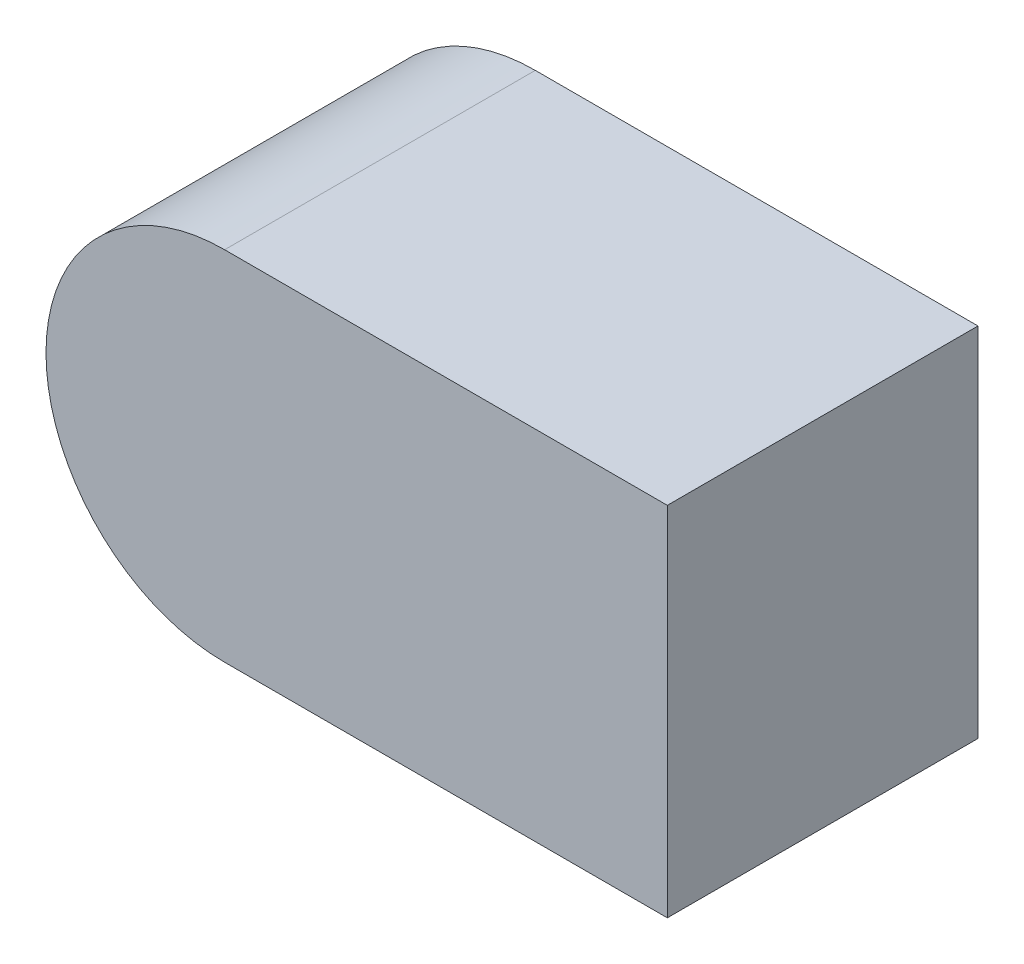
ISO-10303-21;
HEADER;
FILE_DESCRIPTION(('STEP AP214'),'2;1');
FILE_NAME('part.step','',(''),(''),'','','');
FILE_SCHEMA(('AUTOMOTIVE_DESIGN { 1 0 10303 214 1 1 1 1 }'));
ENDSEC;
DATA;
#1=APPLICATION_CONTEXT('core data for automotive mechanical design processes');
#2=APPLICATION_PROTOCOL_DEFINITION('international standard','automotive_design',2000,#1);
#3=PRODUCT_CONTEXT('',#1,'mechanical');
#4=PRODUCT('Part','Part','',(#3));
#5=PRODUCT_RELATED_PRODUCT_CATEGORY('part','',(#4));
#6=PRODUCT_DEFINITION_FORMATION('','',#4);
#7=PRODUCT_DEFINITION_CONTEXT('part definition',#1,'design');
#8=PRODUCT_DEFINITION('design','',#6,#7);
#9=PRODUCT_DEFINITION_SHAPE('','',#8);
#10=(LENGTH_UNIT() NAMED_UNIT(*) SI_UNIT(.MILLI.,.METRE.));
#11=(NAMED_UNIT(*) PLANE_ANGLE_UNIT() SI_UNIT($,.RADIAN.));
#12=(NAMED_UNIT(*) SI_UNIT($,.STERADIAN.) SOLID_ANGLE_UNIT());
#13=UNCERTAINTY_MEASURE_WITH_UNIT(LENGTH_MEASURE(1.E-05),#10,'distance_accuracy_value','');
#14=(GEOMETRIC_REPRESENTATION_CONTEXT(3) GLOBAL_UNCERTAINTY_ASSIGNED_CONTEXT((#13)) GLOBAL_UNIT_ASSIGNED_CONTEXT((#10,
#11,#12)) REPRESENTATION_CONTEXT('',''));
#15=CARTESIAN_POINT('',(0.,0.,0.));
#16=DIRECTION('',(0.,0.,1.));
#17=DIRECTION('',(1.,0.,0.));
#18=AXIS2_PLACEMENT_3D('',#15,#16,#17);
#19=CARTESIAN_POINT('',(2.8335265642716,0.75,0.));
#20=DIRECTION('',(0.,0.,1.));
#21=DIRECTION('',(-1.,0.,0.));
#22=AXIS2_PLACEMENT_3D('',#19,#20,#21);
#23=PLANE('',#22);
#24=DIRECTION('',(0.,1.,0.));
#25=VECTOR('',#24,1.);
#26=CARTESIAN_POINT('',(3.,0.635,0.));
#27=LINE('',#26,#25);
#28=CARTESIAN_POINT('',(3.,0.635,0.));
#29=VERTEX_POINT('',#28);
#30=CARTESIAN_POINT('',(3.,0.865,0.));
#31=VERTEX_POINT('',#30);
#32=EDGE_CURVE('E11',#29,#31,#27,.T.);
#33=ORIENTED_EDGE('',*,*,#32,.F.);
#34=DIRECTION('',(1.,0.,0.));
#35=VECTOR('',#34,1.);
#36=CARTESIAN_POINT('',(2.715,0.635,0.));
#37=LINE('',#36,#35);
#38=CARTESIAN_POINT('',(2.715,0.635,0.));
#39=VERTEX_POINT('',#38);
#40=EDGE_CURVE('E24',#39,#29,#37,.T.);
#41=ORIENTED_EDGE('',*,*,#40,.F.);
#42=CARTESIAN_POINT('',(2.715,0.75,0.));
#43=DIRECTION('',(0.,0.,1.));
#44=DIRECTION('',(0.,1.,0.));
#45=AXIS2_PLACEMENT_3D('',#42,#43,#44);
#46=CIRCLE('',#45,0.115);
#47=CARTESIAN_POINT('',(2.715,0.865,0.));
#48=VERTEX_POINT('',#47);
#49=EDGE_CURVE('E85',#48,#39,#46,.T.);
#50=ORIENTED_EDGE('',*,*,#49,.F.);
#51=DIRECTION('',(-1.,0.,0.));
#52=VECTOR('',#51,1.);
#53=CARTESIAN_POINT('',(3.,0.865,0.));
#54=LINE('',#53,#52);
#55=EDGE_CURVE('E82',#31,#48,#54,.T.);
#56=ORIENTED_EDGE('',*,*,#55,.F.);
#57=EDGE_LOOP('',(#33,#41,#50,#56));
#58=FACE_BOUND('',#57,.T.);
#59=ADVANCED_FACE('F17',(#58),#23,.F.);
#60=CARTESIAN_POINT('',(3.,0.865,0.));
#61=DIRECTION('',(0.,1.,0.));
#62=DIRECTION('',(-1.,0.,0.));
#63=AXIS2_PLACEMENT_3D('',#60,#61,#62);
#64=PLANE('',#63);
#65=ORIENTED_EDGE('',*,*,#55,.T.);
#66=DIRECTION('',(0.,0.,1.));
#67=VECTOR('',#66,1.);
#68=CARTESIAN_POINT('',(2.715,0.865,0.));
#69=LINE('',#68,#67);
#70=CARTESIAN_POINT('',(2.715,0.865,0.2));
#71=VERTEX_POINT('',#70);
#72=EDGE_CURVE('E80',#48,#71,#69,.T.);
#73=ORIENTED_EDGE('',*,*,#72,.T.);
#74=DIRECTION('',(-1.,0.,0.));
#75=VECTOR('',#74,1.);
#76=CARTESIAN_POINT('',(3.,0.865,0.2));
#77=LINE('',#76,#75);
#78=CARTESIAN_POINT('',(3.,0.865,0.2));
#79=VERTEX_POINT('',#78);
#80=EDGE_CURVE('E78',#79,#71,#77,.T.);
#81=ORIENTED_EDGE('',*,*,#80,.F.);
#82=DIRECTION('',(0.,0.,-1.));
#83=VECTOR('',#82,1.);
#84=CARTESIAN_POINT('',(3.,0.865,0.));
#85=LINE('',#84,#83);
#86=EDGE_CURVE('E71',#79,#31,#85,.T.);
#87=ORIENTED_EDGE('',*,*,#86,.T.);
#88=EDGE_LOOP('',(#65,#73,#81,#87));
#89=FACE_BOUND('',#88,.T.);
#90=ADVANCED_FACE('F91',(#89),#64,.T.);
#91=CARTESIAN_POINT('',(2.715,0.75,0.));
#92=DIRECTION('',(0.,0.,1.));
#93=DIRECTION('',(0.,1.,0.));
#94=AXIS2_PLACEMENT_3D('',#91,#92,#93);
#95=CYLINDRICAL_SURFACE('',#94,0.115);
#96=ORIENTED_EDGE('',*,*,#49,.T.);
#97=DIRECTION('',(0.,0.,1.));
#98=VECTOR('',#97,1.);
#99=CARTESIAN_POINT('',(2.715,0.635,0.));
#100=LINE('',#99,#98);
#101=CARTESIAN_POINT('',(2.715,0.635,0.2));
#102=VERTEX_POINT('',#101);
#103=EDGE_CURVE('E75',#39,#102,#100,.T.);
#104=ORIENTED_EDGE('',*,*,#103,.T.);
#105=CARTESIAN_POINT('',(2.715,0.75,0.2));
#106=DIRECTION('',(0.,0.,1.));
#107=DIRECTION('',(0.,1.,0.));
#108=AXIS2_PLACEMENT_3D('',#105,#106,#107);
#109=CIRCLE('',#108,0.115);
#110=EDGE_CURVE('E59',#71,#102,#109,.T.);
#111=ORIENTED_EDGE('',*,*,#110,.F.);
#112=ORIENTED_EDGE('',*,*,#72,.F.);
#113=EDGE_LOOP('',(#96,#104,#111,#112));
#114=FACE_BOUND('',#113,.T.);
#115=ADVANCED_FACE('F89',(#114),#95,.T.);
#116=CARTESIAN_POINT('',(2.715,0.635,0.));
#117=DIRECTION('',(0.,-1.,0.));
#118=DIRECTION('',(1.,0.,0.));
#119=AXIS2_PLACEMENT_3D('',#116,#117,#118);
#120=PLANE('',#119);
#121=ORIENTED_EDGE('',*,*,#40,.T.);
#122=DIRECTION('',(0.,0.,1.));
#123=VECTOR('',#122,1.);
#124=CARTESIAN_POINT('',(3.,0.635,0.));
#125=LINE('',#124,#123);
#126=CARTESIAN_POINT('',(3.,0.635,0.2));
#127=VERTEX_POINT('',#126);
#128=EDGE_CURVE('E53',#29,#127,#125,.T.);
#129=ORIENTED_EDGE('',*,*,#128,.T.);
#130=DIRECTION('',(1.,0.,0.));
#131=VECTOR('',#130,1.);
#132=CARTESIAN_POINT('',(2.715,0.635,0.2));
#133=LINE('',#132,#131);
#134=EDGE_CURVE('E57',#102,#127,#133,.T.);
#135=ORIENTED_EDGE('',*,*,#134,.F.);
#136=ORIENTED_EDGE('',*,*,#103,.F.);
#137=EDGE_LOOP('',(#121,#129,#135,#136));
#138=FACE_BOUND('',#137,.T.);
#139=ADVANCED_FACE('F55',(#138),#120,.T.);
#140=CARTESIAN_POINT('',(3.,-3.,0.));
#141=DIRECTION('',(1.,0.,0.));
#142=DIRECTION('',(0.,1.,0.));
#143=AXIS2_PLACEMENT_3D('',#140,#141,#142);
#144=PLANE('',#143);
#145=ORIENTED_EDGE('',*,*,#86,.F.);
#146=DIRECTION('',(0.,1.,0.));
#147=VECTOR('',#146,1.);
#148=CARTESIAN_POINT('',(3.,-1.125,0.2));
#149=LINE('',#148,#147);
#150=EDGE_CURVE('E66',#127,#79,#149,.T.);
#151=ORIENTED_EDGE('',*,*,#150,.F.);
#152=ORIENTED_EDGE('',*,*,#128,.F.);
#153=ORIENTED_EDGE('',*,*,#32,.T.);
#154=EDGE_LOOP('',(#145,#151,#152,#153));
#155=FACE_BOUND('',#154,.T.);
#156=ADVANCED_FACE('F69',(#155),#144,.T.);
#157=CARTESIAN_POINT('',(2.8335240809167,0.75,0.2));
#158=DIRECTION('',(0.,0.,1.));
#159=DIRECTION('',(1.,0.,0.));
#160=AXIS2_PLACEMENT_3D('',#157,#158,#159);
#161=PLANE('',#160);
#162=ORIENTED_EDGE('',*,*,#134,.T.);
#163=ORIENTED_EDGE('',*,*,#150,.T.);
#164=ORIENTED_EDGE('',*,*,#80,.T.);
#165=ORIENTED_EDGE('',*,*,#110,.T.);
#166=EDGE_LOOP('',(#162,#163,#164,#165));
#167=FACE_BOUND('',#166,.T.);
#168=ADVANCED_FACE('F64',(#167),#161,.T.);
#169=CLOSED_SHELL('',(#59,#90,#115,#139,#156,#168));
#170=MANIFOLD_SOLID_BREP('B1',#169);
#171=ADVANCED_BREP_SHAPE_REPRESENTATION('',(#18,#170),#14);
#172=SHAPE_DEFINITION_REPRESENTATION(#9,#171);
ENDSEC;
END-ISO-10303-21;
